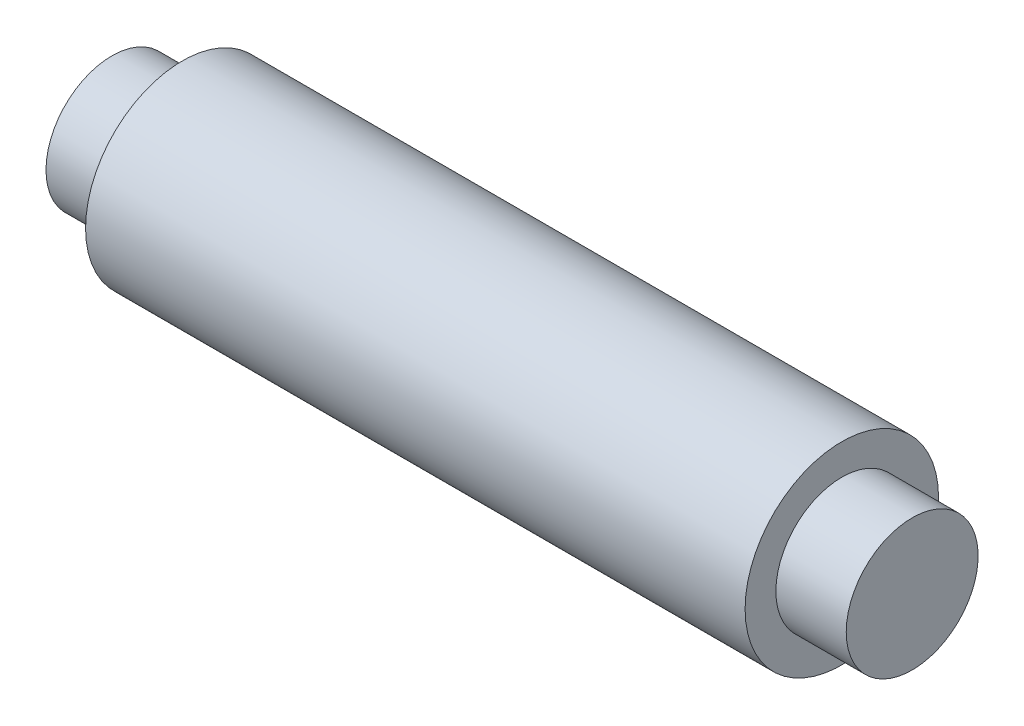
ISO-10303-21;
HEADER;
FILE_DESCRIPTION(('STEP AP214'),'2;1');
FILE_NAME('part.step','',(''),(''),'','','');
FILE_SCHEMA(('AUTOMOTIVE_DESIGN { 1 0 10303 214 1 1 1 1 }'));
ENDSEC;
DATA;
#1=APPLICATION_CONTEXT('core data for automotive mechanical design processes');
#2=APPLICATION_PROTOCOL_DEFINITION('international standard','automotive_design',2000,#1);
#3=PRODUCT_CONTEXT('',#1,'mechanical');
#4=PRODUCT('Part','Part','',(#3));
#5=PRODUCT_RELATED_PRODUCT_CATEGORY('part','',(#4));
#6=PRODUCT_DEFINITION_FORMATION('','',#4);
#7=PRODUCT_DEFINITION_CONTEXT('part definition',#1,'design');
#8=PRODUCT_DEFINITION('design','',#6,#7);
#9=PRODUCT_DEFINITION_SHAPE('','',#8);
#10=(LENGTH_UNIT() NAMED_UNIT(*) SI_UNIT(.MILLI.,.METRE.));
#11=(NAMED_UNIT(*) PLANE_ANGLE_UNIT() SI_UNIT($,.RADIAN.));
#12=(NAMED_UNIT(*) SI_UNIT($,.STERADIAN.) SOLID_ANGLE_UNIT());
#13=UNCERTAINTY_MEASURE_WITH_UNIT(LENGTH_MEASURE(1.E-05),#10,'distance_accuracy_value','');
#14=(GEOMETRIC_REPRESENTATION_CONTEXT(3) GLOBAL_UNCERTAINTY_ASSIGNED_CONTEXT((#13)) GLOBAL_UNIT_ASSIGNED_CONTEXT((#10,
#11,#12)) REPRESENTATION_CONTEXT('',''));
#15=CARTESIAN_POINT('',(0.,0.,0.));
#16=DIRECTION('',(0.,0.,1.));
#17=DIRECTION('',(1.,0.,0.));
#18=AXIS2_PLACEMENT_3D('',#15,#16,#17);
#19=CARTESIAN_POINT('',(-45.5,0.,0.));
#20=DIRECTION('',(1.,0.,0.));
#21=DIRECTION('',(0.,0.,-1.));
#22=AXIS2_PLACEMENT_3D('',#19,#20,#21);
#23=PLANE('',#22);
#24=CARTESIAN_POINT('',(-45.5,0.,0.));
#25=DIRECTION('',(-1.,0.,0.));
#26=DIRECTION('',(0.,0.,1.));
#27=AXIS2_PLACEMENT_3D('',#24,#25,#26);
#28=CIRCLE('',#27,7.5);
#29=CARTESIAN_POINT('',(-45.5,0.,7.5));
#30=VERTEX_POINT('',#29);
#31=EDGE_CURVE('E10',#30,#30,#28,.T.);
#32=ORIENTED_EDGE('',*,*,#31,.T.);
#33=EDGE_LOOP('',(#32));
#34=FACE_BOUND('',#33,.T.);
#35=ADVANCED_FACE('F35',(#34),#23,.F.);
#36=CARTESIAN_POINT('',(-45.5,0.,0.));
#37=DIRECTION('',(-1.,0.,0.));
#38=DIRECTION('',(0.,0.,1.));
#39=AXIS2_PLACEMENT_3D('',#36,#37,#38);
#40=CYLINDRICAL_SURFACE('',#39,7.5);
#41=ORIENTED_EDGE('',*,*,#31,.F.);
#42=EDGE_LOOP('',(#41));
#43=FACE_BOUND('',#42,.T.);
#44=CARTESIAN_POINT('',(-37.5,0.,0.));
#45=DIRECTION('',(-1.,0.,0.));
#46=DIRECTION('',(0.,0.,1.));
#47=AXIS2_PLACEMENT_3D('',#44,#45,#46);
#48=CIRCLE('',#47,7.5);
#49=CARTESIAN_POINT('',(-37.5,0.,7.5));
#50=VERTEX_POINT('',#49);
#51=EDGE_CURVE('E41',#50,#50,#48,.T.);
#52=ORIENTED_EDGE('',*,*,#51,.T.);
#53=EDGE_LOOP('',(#52));
#54=FACE_BOUND('',#53,.T.);
#55=ADVANCED_FACE('F73',(#43,#54),#40,.T.);
#56=CARTESIAN_POINT('',(-37.5,7.5,0.));
#57=DIRECTION('',(1.,0.,0.));
#58=DIRECTION('',(0.,0.,-1.));
#59=AXIS2_PLACEMENT_3D('',#56,#57,#58);
#60=PLANE('',#59);
#61=ORIENTED_EDGE('',*,*,#51,.F.);
#62=EDGE_LOOP('',(#61));
#63=FACE_BOUND('',#62,.T.);
#64=CARTESIAN_POINT('',(-37.5,0.,0.));
#65=DIRECTION('',(-1.,0.,0.));
#66=DIRECTION('',(0.,0.,1.));
#67=AXIS2_PLACEMENT_3D('',#64,#65,#66);
#68=CIRCLE('',#67,11.);
#69=CARTESIAN_POINT('',(-37.5,0.,11.));
#70=VERTEX_POINT('',#69);
#71=EDGE_CURVE('E45',#70,#70,#68,.T.);
#72=ORIENTED_EDGE('',*,*,#71,.T.);
#73=EDGE_LOOP('',(#72));
#74=FACE_BOUND('',#73,.T.);
#75=ADVANCED_FACE('F77',(#63,#74),#60,.F.);
#76=CARTESIAN_POINT('',(-45.5,0.,0.));
#77=DIRECTION('',(-1.,0.,0.));
#78=DIRECTION('',(0.,0.,1.));
#79=AXIS2_PLACEMENT_3D('',#76,#77,#78);
#80=CYLINDRICAL_SURFACE('',#79,11.);
#81=ORIENTED_EDGE('',*,*,#71,.F.);
#82=EDGE_LOOP('',(#81));
#83=FACE_BOUND('',#82,.T.);
#84=CARTESIAN_POINT('',(37.5,0.,0.));
#85=DIRECTION('',(-1.,0.,0.));
#86=DIRECTION('',(0.,0.,1.));
#87=AXIS2_PLACEMENT_3D('',#84,#85,#86);
#88=CIRCLE('',#87,11.);
#89=CARTESIAN_POINT('',(37.5,0.,11.));
#90=VERTEX_POINT('',#89);
#91=EDGE_CURVE('E49',#90,#90,#88,.T.);
#92=ORIENTED_EDGE('',*,*,#91,.T.);
#93=EDGE_LOOP('',(#92));
#94=FACE_BOUND('',#93,.T.);
#95=ADVANCED_FACE('F82',(#83,#94),#80,.T.);
#96=CARTESIAN_POINT('',(37.5,11.,0.));
#97=DIRECTION('',(-1.,0.,0.));
#98=DIRECTION('',(0.,0.,1.));
#99=AXIS2_PLACEMENT_3D('',#96,#97,#98);
#100=PLANE('',#99);
#101=ORIENTED_EDGE('',*,*,#91,.F.);
#102=EDGE_LOOP('',(#101));
#103=FACE_BOUND('',#102,.T.);
#104=CARTESIAN_POINT('',(37.5,0.,0.));
#105=DIRECTION('',(-1.,0.,0.));
#106=DIRECTION('',(0.,0.,1.));
#107=AXIS2_PLACEMENT_3D('',#104,#105,#106);
#108=CIRCLE('',#107,7.5);
#109=CARTESIAN_POINT('',(37.5,0.,7.5));
#110=VERTEX_POINT('',#109);
#111=EDGE_CURVE('E54',#110,#110,#108,.T.);
#112=ORIENTED_EDGE('',*,*,#111,.T.);
#113=EDGE_LOOP('',(#112));
#114=FACE_BOUND('',#113,.T.);
#115=ADVANCED_FACE('F69',(#103,#114),#100,.F.);
#116=CARTESIAN_POINT('',(-45.5,0.,0.));
#117=DIRECTION('',(-1.,0.,0.));
#118=DIRECTION('',(0.,0.,1.));
#119=AXIS2_PLACEMENT_3D('',#116,#117,#118);
#120=CYLINDRICAL_SURFACE('',#119,7.5);
#121=ORIENTED_EDGE('',*,*,#111,.F.);
#122=EDGE_LOOP('',(#121));
#123=FACE_BOUND('',#122,.T.);
#124=CARTESIAN_POINT('',(45.5,0.,0.));
#125=DIRECTION('',(-1.,0.,0.));
#126=DIRECTION('',(0.,0.,1.));
#127=AXIS2_PLACEMENT_3D('',#124,#125,#126);
#128=CIRCLE('',#127,7.5);
#129=CARTESIAN_POINT('',(45.5,0.,7.5));
#130=VERTEX_POINT('',#129);
#131=EDGE_CURVE('E57',#130,#130,#128,.T.);
#132=ORIENTED_EDGE('',*,*,#131,.T.);
#133=EDGE_LOOP('',(#132));
#134=FACE_BOUND('',#133,.T.);
#135=ADVANCED_FACE('F61',(#123,#134),#120,.T.);
#136=CARTESIAN_POINT('',(45.5,7.5,0.));
#137=DIRECTION('',(-1.,0.,0.));
#138=DIRECTION('',(0.,0.,1.));
#139=AXIS2_PLACEMENT_3D('',#136,#137,#138);
#140=PLANE('',#139);
#141=ORIENTED_EDGE('',*,*,#131,.F.);
#142=EDGE_LOOP('',(#141));
#143=FACE_BOUND('',#142,.T.);
#144=ADVANCED_FACE('F63',(#143),#140,.F.);
#145=CLOSED_SHELL('',(#35,#55,#75,#95,#115,#135,#144));
#146=MANIFOLD_SOLID_BREP('B2',#145);
#147=ADVANCED_BREP_SHAPE_REPRESENTATION('',(#18,#146),#14);
#148=SHAPE_DEFINITION_REPRESENTATION(#9,#147);
ENDSEC;
END-ISO-10303-21;
